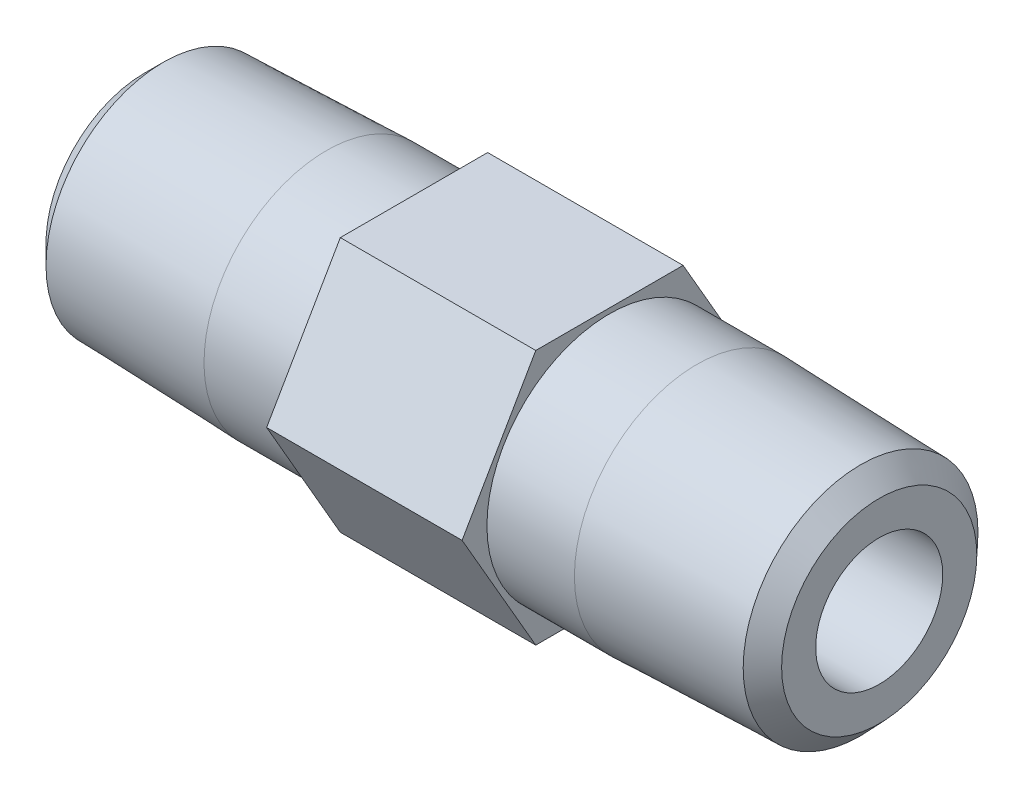
ISO-10303-21;
HEADER;
FILE_DESCRIPTION(('STEP AP214'),'2;1');
FILE_NAME('part.step','',(''),(''),'','','');
FILE_SCHEMA(('AUTOMOTIVE_DESIGN { 1 0 10303 214 1 1 1 1 }'));
ENDSEC;
DATA;
#1=APPLICATION_CONTEXT('core data for automotive mechanical design processes');
#2=APPLICATION_PROTOCOL_DEFINITION('international standard','automotive_design',2000,#1);
#3=PRODUCT_CONTEXT('',#1,'mechanical');
#4=PRODUCT('Part','Part','',(#3));
#5=PRODUCT_RELATED_PRODUCT_CATEGORY('part','',(#4));
#6=PRODUCT_DEFINITION_FORMATION('','',#4);
#7=PRODUCT_DEFINITION_CONTEXT('part definition',#1,'design');
#8=PRODUCT_DEFINITION('design','',#6,#7);
#9=PRODUCT_DEFINITION_SHAPE('','',#8);
#10=(LENGTH_UNIT() NAMED_UNIT(*) SI_UNIT(.MILLI.,.METRE.));
#11=(NAMED_UNIT(*) PLANE_ANGLE_UNIT() SI_UNIT($,.RADIAN.));
#12=(NAMED_UNIT(*) SI_UNIT($,.STERADIAN.) SOLID_ANGLE_UNIT());
#13=UNCERTAINTY_MEASURE_WITH_UNIT(LENGTH_MEASURE(1.E-05),#10,'distance_accuracy_value','');
#14=(GEOMETRIC_REPRESENTATION_CONTEXT(3) GLOBAL_UNCERTAINTY_ASSIGNED_CONTEXT((#13)) GLOBAL_UNIT_ASSIGNED_CONTEXT((#10,
#11,#12)) REPRESENTATION_CONTEXT('',''));
#15=CARTESIAN_POINT('',(0.,0.,0.));
#16=DIRECTION('',(0.,0.,1.));
#17=DIRECTION('',(1.,0.,0.));
#18=AXIS2_PLACEMENT_3D('',#15,#16,#17);
#19=CARTESIAN_POINT('',(26.04516,0.,-8.24889197104678));
#20=DIRECTION('',(0.,-0.5,-0.866025403784438));
#21=DIRECTION('',(0.,0.866025403784438,-0.5));
#22=AXIS2_PLACEMENT_3D('',#19,#20,#21);
#23=PLANE('',#22);
#24=DIRECTION('',(0.,-0.866025403784438,0.5));
#25=VECTOR('',#24,1.);
#26=CARTESIAN_POINT('',(15.10284,0.,-8.24889197104678));
#27=LINE('',#26,#25);
#28=CARTESIAN_POINT('',(15.10284,0.,-8.24889197104678));
#29=VERTEX_POINT('',#28);
#30=CARTESIAN_POINT('',(15.10284,-7.14375,-4.12444598552339));
#31=VERTEX_POINT('',#30);
#32=EDGE_CURVE('E123',#29,#31,#27,.T.);
#33=ORIENTED_EDGE('',*,*,#32,.F.);
#34=DIRECTION('',(-1.,0.,0.));
#35=VECTOR('',#34,1.);
#36=CARTESIAN_POINT('',(26.04516,0.,-8.24889197104678));
#37=LINE('',#36,#35);
#38=CARTESIAN_POINT('',(26.04516,0.,-8.24889197104678));
#39=VERTEX_POINT('',#38);
#40=EDGE_CURVE('E52',#39,#29,#37,.T.);
#41=ORIENTED_EDGE('',*,*,#40,.F.);
#42=DIRECTION('',(0.,-0.866025403784438,0.5));
#43=VECTOR('',#42,1.);
#44=CARTESIAN_POINT('',(26.04516,0.,-8.24889197104678));
#45=LINE('',#44,#43);
#46=CARTESIAN_POINT('',(26.04516,-7.14375,-4.12444598552339));
#47=VERTEX_POINT('',#46);
#48=EDGE_CURVE('E139',#39,#47,#45,.T.);
#49=ORIENTED_EDGE('',*,*,#48,.T.);
#50=DIRECTION('',(-1.,0.,0.));
#51=VECTOR('',#50,1.);
#52=CARTESIAN_POINT('',(26.04516,-7.14375,-4.12444598552339));
#53=LINE('',#52,#51);
#54=EDGE_CURVE('E87',#47,#31,#53,.T.);
#55=ORIENTED_EDGE('',*,*,#54,.T.);
#56=EDGE_LOOP('',(#33,#41,#49,#55));
#57=FACE_BOUND('',#56,.T.);
#58=ADVANCED_FACE('F35',(#57),#23,.T.);
#59=CARTESIAN_POINT('',(26.04516,7.14375,-4.12444598552339));
#60=DIRECTION('',(0.,0.5,-0.866025403784439));
#61=DIRECTION('',(0.,0.866025403784439,0.5));
#62=AXIS2_PLACEMENT_3D('',#59,#60,#61);
#63=PLANE('',#62);
#64=DIRECTION('',(0.,-0.866025403784439,-0.5));
#65=VECTOR('',#64,1.);
#66=CARTESIAN_POINT('',(15.10284,7.14375,-4.12444598552339));
#67=LINE('',#66,#65);
#68=CARTESIAN_POINT('',(15.10284,7.14375,-4.12444598552339));
#69=VERTEX_POINT('',#68);
#70=EDGE_CURVE('E136',#69,#29,#67,.T.);
#71=ORIENTED_EDGE('',*,*,#70,.F.);
#72=DIRECTION('',(-1.,0.,0.));
#73=VECTOR('',#72,1.);
#74=CARTESIAN_POINT('',(26.04516,7.14375,-4.12444598552339));
#75=LINE('',#74,#73);
#76=CARTESIAN_POINT('',(26.04516,7.14375,-4.12444598552339));
#77=VERTEX_POINT('',#76);
#78=EDGE_CURVE('E75',#77,#69,#75,.T.);
#79=ORIENTED_EDGE('',*,*,#78,.F.);
#80=DIRECTION('',(0.,-0.866025403784439,-0.5));
#81=VECTOR('',#80,1.);
#82=CARTESIAN_POINT('',(26.04516,7.14375,-4.12444598552339));
#83=LINE('',#82,#81);
#84=EDGE_CURVE('E113',#77,#39,#83,.T.);
#85=ORIENTED_EDGE('',*,*,#84,.T.);
#86=ORIENTED_EDGE('',*,*,#40,.T.);
#87=EDGE_LOOP('',(#71,#79,#85,#86));
#88=FACE_BOUND('',#87,.T.);
#89=ADVANCED_FACE('F168',(#88),#63,.T.);
#90=CARTESIAN_POINT('',(26.04516,7.14375,4.12444598552339));
#91=DIRECTION('',(0.,1.,0.));
#92=DIRECTION('',(0.,0.,1.));
#93=AXIS2_PLACEMENT_3D('',#90,#91,#92);
#94=PLANE('',#93);
#95=DIRECTION('',(0.,0.,-1.));
#96=VECTOR('',#95,1.);
#97=CARTESIAN_POINT('',(15.10284,7.14375,4.12444598552339));
#98=LINE('',#97,#96);
#99=CARTESIAN_POINT('',(15.10284,7.14375,4.12444598552339));
#100=VERTEX_POINT('',#99);
#101=EDGE_CURVE('E100',#100,#69,#98,.T.);
#102=ORIENTED_EDGE('',*,*,#101,.F.);
#103=DIRECTION('',(-1.,0.,0.));
#104=VECTOR('',#103,1.);
#105=CARTESIAN_POINT('',(26.04516,7.14375,4.12444598552339));
#106=LINE('',#105,#104);
#107=CARTESIAN_POINT('',(26.04516,7.14375,4.12444598552339));
#108=VERTEX_POINT('',#107);
#109=EDGE_CURVE('E95',#108,#100,#106,.T.);
#110=ORIENTED_EDGE('',*,*,#109,.F.);
#111=DIRECTION('',(0.,0.,-1.));
#112=VECTOR('',#111,1.);
#113=CARTESIAN_POINT('',(26.04516,7.14375,4.12444598552339));
#114=LINE('',#113,#112);
#115=EDGE_CURVE('E98',#108,#77,#114,.T.);
#116=ORIENTED_EDGE('',*,*,#115,.T.);
#117=ORIENTED_EDGE('',*,*,#78,.T.);
#118=EDGE_LOOP('',(#102,#110,#116,#117));
#119=FACE_BOUND('',#118,.T.);
#120=ADVANCED_FACE('F97',(#119),#94,.T.);
#121=CARTESIAN_POINT('',(26.04516,0.,8.24889197104678));
#122=DIRECTION('',(0.,0.5,0.866025403784438));
#123=DIRECTION('',(0.,-0.866025403784439,0.5));
#124=AXIS2_PLACEMENT_3D('',#121,#122,#123);
#125=PLANE('',#124);
#126=DIRECTION('',(0.,0.866025403784439,-0.5));
#127=VECTOR('',#126,1.);
#128=CARTESIAN_POINT('',(15.10284,0.,8.24889197104678));
#129=LINE('',#128,#127);
#130=CARTESIAN_POINT('',(15.10284,0.,8.24889197104678));
#131=VERTEX_POINT('',#130);
#132=EDGE_CURVE('E133',#131,#100,#129,.T.);
#133=ORIENTED_EDGE('',*,*,#132,.F.);
#134=DIRECTION('',(-1.,0.,0.));
#135=VECTOR('',#134,1.);
#136=CARTESIAN_POINT('',(26.04516,0.,8.24889197104678));
#137=LINE('',#136,#135);
#138=CARTESIAN_POINT('',(26.04516,0.,8.24889197104678));
#139=VERTEX_POINT('',#138);
#140=EDGE_CURVE('E105',#139,#131,#137,.T.);
#141=ORIENTED_EDGE('',*,*,#140,.F.);
#142=DIRECTION('',(0.,0.866025403784439,-0.5));
#143=VECTOR('',#142,1.);
#144=CARTESIAN_POINT('',(26.04516,0.,8.24889197104678));
#145=LINE('',#144,#143);
#146=EDGE_CURVE('E111',#139,#108,#145,.T.);
#147=ORIENTED_EDGE('',*,*,#146,.T.);
#148=ORIENTED_EDGE('',*,*,#109,.T.);
#149=EDGE_LOOP('',(#133,#141,#147,#148));
#150=FACE_BOUND('',#149,.T.);
#151=ADVANCED_FACE('F115',(#150),#125,.T.);
#152=CARTESIAN_POINT('',(26.04516,-7.14375,4.12444598552339));
#153=DIRECTION('',(0.,-0.5,0.866025403784439));
#154=DIRECTION('',(0.,-0.866025403784439,-0.5));
#155=AXIS2_PLACEMENT_3D('',#152,#153,#154);
#156=PLANE('',#155);
#157=DIRECTION('',(0.,0.866025403784439,0.5));
#158=VECTOR('',#157,1.);
#159=CARTESIAN_POINT('',(15.10284,-7.14375,4.12444598552339));
#160=LINE('',#159,#158);
#161=CARTESIAN_POINT('',(15.10284,-7.14375,4.12444598552339));
#162=VERTEX_POINT('',#161);
#163=EDGE_CURVE('E130',#162,#131,#160,.T.);
#164=ORIENTED_EDGE('',*,*,#163,.F.);
#165=DIRECTION('',(-1.,0.,0.));
#166=VECTOR('',#165,1.);
#167=CARTESIAN_POINT('',(26.04516,-7.14375,4.12444598552339));
#168=LINE('',#167,#166);
#169=CARTESIAN_POINT('',(26.04516,-7.14375,4.12444598552339));
#170=VERTEX_POINT('',#169);
#171=EDGE_CURVE('E144',#170,#162,#168,.T.);
#172=ORIENTED_EDGE('',*,*,#171,.F.);
#173=DIRECTION('',(0.,0.866025403784439,0.5));
#174=VECTOR('',#173,1.);
#175=CARTESIAN_POINT('',(26.04516,-7.14375,4.12444598552339));
#176=LINE('',#175,#174);
#177=EDGE_CURVE('E116',#170,#139,#176,.T.);
#178=ORIENTED_EDGE('',*,*,#177,.T.);
#179=ORIENTED_EDGE('',*,*,#140,.T.);
#180=EDGE_LOOP('',(#164,#172,#178,#179));
#181=FACE_BOUND('',#180,.T.);
#182=ADVANCED_FACE('F178',(#181),#156,.T.);
#183=CARTESIAN_POINT('',(26.04516,-7.14375,-4.12444598552339));
#184=DIRECTION('',(0.,-1.,0.));
#185=DIRECTION('',(1.,0.,0.));
#186=AXIS2_PLACEMENT_3D('',#183,#184,#185);
#187=PLANE('',#186);
#188=DIRECTION('',(0.,0.,1.));
#189=VECTOR('',#188,1.);
#190=CARTESIAN_POINT('',(15.10284,-7.14375,-4.12444598552339));
#191=LINE('',#190,#189);
#192=EDGE_CURVE('E126',#31,#162,#191,.T.);
#193=ORIENTED_EDGE('',*,*,#192,.F.);
#194=ORIENTED_EDGE('',*,*,#54,.F.);
#195=DIRECTION('',(0.,0.,1.));
#196=VECTOR('',#195,1.);
#197=CARTESIAN_POINT('',(26.04516,-7.14375,-4.12444598552339));
#198=LINE('',#197,#196);
#199=EDGE_CURVE('E118',#47,#170,#198,.T.);
#200=ORIENTED_EDGE('',*,*,#199,.T.);
#201=ORIENTED_EDGE('',*,*,#171,.T.);
#202=EDGE_LOOP('',(#193,#194,#200,#201));
#203=FACE_BOUND('',#202,.T.);
#204=ADVANCED_FACE('F175',(#203),#187,.T.);
#205=CARTESIAN_POINT('',(26.04516,0.,0.));
#206=DIRECTION('',(-1.,0.,0.));
#207=DIRECTION('',(0.,0.,1.));
#208=AXIS2_PLACEMENT_3D('',#205,#206,#207);
#209=PLANE('',#208);
#210=CARTESIAN_POINT('',(26.04516,0.,0.));
#211=DIRECTION('',(-1.,0.,0.));
#212=DIRECTION('',(0.,0.,1.));
#213=AXIS2_PLACEMENT_3D('',#210,#211,#212);
#214=CIRCLE('',#213,6.85800000000114);
#215=CARTESIAN_POINT('',(26.04516,0.,6.85800000000114));
#216=VERTEX_POINT('',#215);
#217=EDGE_CURVE('E127',#216,#216,#214,.T.);
#218=ORIENTED_EDGE('',*,*,#217,.T.);
#219=EDGE_LOOP('',(#218));
#220=FACE_BOUND('',#219,.T.);
#221=ORIENTED_EDGE('',*,*,#48,.F.);
#222=ORIENTED_EDGE('',*,*,#84,.F.);
#223=ORIENTED_EDGE('',*,*,#115,.F.);
#224=ORIENTED_EDGE('',*,*,#146,.F.);
#225=ORIENTED_EDGE('',*,*,#177,.F.);
#226=ORIENTED_EDGE('',*,*,#199,.F.);
#227=EDGE_LOOP('',(#221,#222,#223,#224,#225,#226));
#228=FACE_BOUND('',#227,.T.);
#229=ADVANCED_FACE('F109',(#220,#228),#209,.F.);
#230=CARTESIAN_POINT('',(15.10284,0.,0.));
#231=DIRECTION('',(-1.,0.,0.));
#232=DIRECTION('',(0.,0.,1.));
#233=AXIS2_PLACEMENT_3D('',#230,#231,#232);
#234=PLANE('',#233);
#235=CARTESIAN_POINT('',(15.10284,0.,0.));
#236=DIRECTION('',(-1.,0.,0.));
#237=DIRECTION('',(0.,-1.,0.));
#238=AXIS2_PLACEMENT_3D('',#235,#236,#237);
#239=CIRCLE('',#238,6.858);
#240=CARTESIAN_POINT('',(15.10284,-6.858,0.));
#241=VERTEX_POINT('',#240);
#242=EDGE_CURVE('E141',#241,#241,#239,.T.);
#243=ORIENTED_EDGE('',*,*,#242,.F.);
#244=EDGE_LOOP('',(#243));
#245=FACE_BOUND('',#244,.T.);
#246=ORIENTED_EDGE('',*,*,#32,.T.);
#247=ORIENTED_EDGE('',*,*,#192,.T.);
#248=ORIENTED_EDGE('',*,*,#163,.T.);
#249=ORIENTED_EDGE('',*,*,#132,.T.);
#250=ORIENTED_EDGE('',*,*,#101,.T.);
#251=ORIENTED_EDGE('',*,*,#70,.T.);
#252=EDGE_LOOP('',(#246,#247,#248,#249,#250,#251));
#253=FACE_BOUND('',#252,.T.);
#254=ADVANCED_FACE('F186',(#245,#253),#234,.T.);
#255=CARTESIAN_POINT('',(30.9422799999766,0.,0.));
#256=DIRECTION('',(-1.,0.,0.));
#257=DIRECTION('',(0.,0.,1.));
#258=AXIS2_PLACEMENT_3D('',#255,#256,#257);
#259=CONICAL_SURFACE('',#258,6.85800000000114,0.0311250383214261);
#260=CARTESIAN_POINT('',(40.106090931225,0.,0.));
#261=DIRECTION('',(1.,0.,0.));
#262=DIRECTION('',(0.,0.,-1.));
#263=AXIS2_PLACEMENT_3D('',#260,#261,#262);
#264=CIRCLE('',#263,6.57268389260544);
#265=CARTESIAN_POINT('',(40.106090931225,0.,-6.57268389260544));
#266=VERTEX_POINT('',#265);
#267=EDGE_CURVE('E147',#266,#266,#264,.F.);
#268=ORIENTED_EDGE('',*,*,#267,.T.);
#269=EDGE_LOOP('',(#268));
#270=FACE_BOUND('',#269,.T.);
#271=CARTESIAN_POINT('',(30.9422799999766,0.,0.));
#272=DIRECTION('',(-1.,0.,0.));
#273=DIRECTION('',(0.,0.,1.));
#274=AXIS2_PLACEMENT_3D('',#271,#272,#273);
#275=CIRCLE('',#274,6.85800000000114);
#276=CARTESIAN_POINT('',(30.9422799999766,0.,6.85800000000114));
#277=VERTEX_POINT('',#276);
#278=EDGE_CURVE('E250',#277,#277,#275,.T.);
#279=ORIENTED_EDGE('',*,*,#278,.F.);
#280=EDGE_LOOP('',(#279));
#281=FACE_BOUND('',#280,.T.);
#282=ADVANCED_FACE('F189',(#270,#281),#259,.T.);
#283=CARTESIAN_POINT('',(41.148,6.54024395664501,0.));
#284=DIRECTION('',(1.,0.,0.));
#285=DIRECTION('',(0.,0.,-1.));
#286=AXIS2_PLACEMENT_3D('',#283,#284,#285);
#287=PLANE('',#286);
#288=CARTESIAN_POINT('',(41.148,0.,0.));
#289=DIRECTION('',(1.,0.,0.));
#290=DIRECTION('',(0.,0.,-1.));
#291=AXIS2_PLACEMENT_3D('',#288,#289,#290);
#292=CIRCLE('',#291,5.46380999574616);
#293=CARTESIAN_POINT('',(41.148,0.,-5.46380999574616));
#294=VERTEX_POINT('',#293);
#295=EDGE_CURVE('E150',#294,#294,#292,.T.);
#296=ORIENTED_EDGE('',*,*,#295,.T.);
#297=EDGE_LOOP('',(#296));
#298=FACE_BOUND('',#297,.T.);
#299=CARTESIAN_POINT('',(41.148,0.,0.));
#300=DIRECTION('',(1.,0.,0.));
#301=DIRECTION('',(0.,0.,-1.));
#302=AXIS2_PLACEMENT_3D('',#299,#300,#301);
#303=CIRCLE('',#302,3.55599999999999);
#304=CARTESIAN_POINT('',(41.148,0.,-3.55599999999999));
#305=VERTEX_POINT('',#304);
#306=EDGE_CURVE('E239',#305,#305,#303,.T.);
#307=ORIENTED_EDGE('',*,*,#306,.F.);
#308=EDGE_LOOP('',(#307));
#309=FACE_BOUND('',#308,.T.);
#310=ADVANCED_FACE('F196',(#298,#309),#287,.T.);
#311=CARTESIAN_POINT('',(41.148,0.,0.));
#312=DIRECTION('',(-1.,0.,0.));
#313=DIRECTION('',(0.,0.,1.));
#314=AXIS2_PLACEMENT_3D('',#311,#312,#313);
#315=CYLINDRICAL_SURFACE('',#314,6.85800000000114);
#316=ORIENTED_EDGE('',*,*,#278,.T.);
#317=EDGE_LOOP('',(#316));
#318=FACE_BOUND('',#317,.T.);
#319=ORIENTED_EDGE('',*,*,#217,.F.);
#320=EDGE_LOOP('',(#319));
#321=FACE_BOUND('',#320,.T.);
#322=ADVANCED_FACE('F200',(#318,#321),#315,.T.);
#323=CARTESIAN_POINT('',(15.10284,0.,0.));
#324=DIRECTION('',(-1.,0.,0.));
#325=DIRECTION('',(0.,-1.,0.));
#326=AXIS2_PLACEMENT_3D('',#323,#324,#325);
#327=CYLINDRICAL_SURFACE('',#326,6.858);
#328=ORIENTED_EDGE('',*,*,#242,.T.);
#329=EDGE_LOOP('',(#328));
#330=FACE_BOUND('',#329,.T.);
#331=CARTESIAN_POINT('',(10.20572,0.,0.));
#332=DIRECTION('',(-1.,0.,0.));
#333=DIRECTION('',(0.,-1.,0.));
#334=AXIS2_PLACEMENT_3D('',#331,#332,#333);
#335=CIRCLE('',#334,6.858);
#336=CARTESIAN_POINT('',(10.20572,-6.858,0.));
#337=VERTEX_POINT('',#336);
#338=EDGE_CURVE('E247',#337,#337,#335,.T.);
#339=ORIENTED_EDGE('',*,*,#338,.F.);
#340=EDGE_LOOP('',(#339));
#341=FACE_BOUND('',#340,.T.);
#342=ADVANCED_FACE('F204',(#330,#341),#327,.T.);
#343=CARTESIAN_POINT('',(0.,0.,0.));
#344=DIRECTION('',(-1.,0.,0.));
#345=DIRECTION('',(0.,-1.,0.));
#346=AXIS2_PLACEMENT_3D('',#343,#344,#345);
#347=PLANE('',#346);
#348=CARTESIAN_POINT('',(0.,0.,0.));
#349=DIRECTION('',(-1.,0.,0.));
#350=DIRECTION('',(0.,-1.,0.));
#351=AXIS2_PLACEMENT_3D('',#348,#349,#350);
#352=CIRCLE('',#351,5.49782999998399);
#353=CARTESIAN_POINT('',(0.,-5.49782999998399,0.));
#354=VERTEX_POINT('',#353);
#355=EDGE_CURVE('E44',#354,#354,#352,.T.);
#356=ORIENTED_EDGE('',*,*,#355,.T.);
#357=EDGE_LOOP('',(#356));
#358=FACE_BOUND('',#357,.T.);
#359=CARTESIAN_POINT('',(0.,0.,0.));
#360=DIRECTION('',(-1.,0.,0.));
#361=DIRECTION('',(0.,0.,1.));
#362=AXIS2_PLACEMENT_3D('',#359,#360,#361);
#363=CIRCLE('',#362,3.55599999999999);
#364=CARTESIAN_POINT('',(0.,0.,3.55599999999999));
#365=VERTEX_POINT('',#364);
#366=EDGE_CURVE('E237',#365,#365,#363,.T.);
#367=ORIENTED_EDGE('',*,*,#366,.F.);
#368=EDGE_LOOP('',(#367));
#369=FACE_BOUND('',#368,.T.);
#370=ADVANCED_FACE('F155',(#358,#369),#347,.T.);
#371=CARTESIAN_POINT('',(0.,0.,0.));
#372=DIRECTION('',(1.,0.,0.));
#373=DIRECTION('',(0.,1.,0.));
#374=AXIS2_PLACEMENT_3D('',#371,#372,#373);
#375=CONICAL_SURFACE('',#374,6.54024395664457,0.0311250383214294);
#376=CARTESIAN_POINT('',(1.07591259559769,0.,0.));
#377=DIRECTION('',(-1.,0.,0.));
#378=DIRECTION('',(0.,-1.,0.));
#379=AXIS2_PLACEMENT_3D('',#376,#377,#378);
#380=CIRCLE('',#379,6.57374259558169);
#381=CARTESIAN_POINT('',(1.07591259559769,-6.57374259558169,0.));
#382=VERTEX_POINT('',#381);
#383=EDGE_CURVE('E11',#382,#382,#380,.F.);
#384=ORIENTED_EDGE('',*,*,#383,.T.);
#385=EDGE_LOOP('',(#384));
#386=FACE_BOUND('',#385,.T.);
#387=ORIENTED_EDGE('',*,*,#338,.T.);
#388=EDGE_LOOP('',(#387));
#389=FACE_BOUND('',#388,.T.);
#390=ADVANCED_FACE('F211',(#386,#389),#375,.T.);
#391=CARTESIAN_POINT('',(26.04516,0.,0.));
#392=DIRECTION('',(-1.,0.,0.));
#393=DIRECTION('',(0.,0.,1.));
#394=AXIS2_PLACEMENT_3D('',#391,#392,#393);
#395=PLANE('',#394);
#396=CARTESIAN_POINT('',(26.04516,0.,0.));
#397=DIRECTION('',(1.,0.,0.));
#398=DIRECTION('',(0.,0.,-1.));
#399=AXIS2_PLACEMENT_3D('',#396,#397,#398);
#400=CIRCLE('',#399,3.55599999999999);
#401=CARTESIAN_POINT('',(26.04516,0.,-3.55599999999999));
#402=VERTEX_POINT('',#401);
#403=EDGE_CURVE('E244',#402,#402,#400,.T.);
#404=ORIENTED_EDGE('',*,*,#403,.T.);
#405=EDGE_LOOP('',(#404));
#406=FACE_BOUND('',#405,.T.);
#407=ADVANCED_FACE('F214',(#406),#395,.F.);
#408=CARTESIAN_POINT('',(41.148,0.,0.));
#409=DIRECTION('',(1.,0.,0.));
#410=DIRECTION('',(0.,0.,-1.));
#411=AXIS2_PLACEMENT_3D('',#408,#409,#410);
#412=CYLINDRICAL_SURFACE('',#411,3.55599999999999);
#413=ORIENTED_EDGE('',*,*,#403,.F.);
#414=EDGE_LOOP('',(#413));
#415=FACE_BOUND('',#414,.T.);
#416=ORIENTED_EDGE('',*,*,#306,.T.);
#417=EDGE_LOOP('',(#416));
#418=FACE_BOUND('',#417,.T.);
#419=ADVANCED_FACE('F218',(#415,#418),#412,.F.);
#420=CARTESIAN_POINT('',(15.10284,0.,0.));
#421=DIRECTION('',(1.,0.,0.));
#422=DIRECTION('',(0.,0.,-1.));
#423=AXIS2_PLACEMENT_3D('',#420,#421,#422);
#424=PLANE('',#423);
#425=CARTESIAN_POINT('',(15.10284,0.,0.));
#426=DIRECTION('',(-1.,0.,0.));
#427=DIRECTION('',(0.,0.,1.));
#428=AXIS2_PLACEMENT_3D('',#425,#426,#427);
#429=CIRCLE('',#428,3.55599999999999);
#430=CARTESIAN_POINT('',(15.10284,0.,3.55599999999999));
#431=VERTEX_POINT('',#430);
#432=EDGE_CURVE('E234',#431,#431,#429,.T.);
#433=ORIENTED_EDGE('',*,*,#432,.T.);
#434=EDGE_LOOP('',(#433));
#435=FACE_BOUND('',#434,.T.);
#436=ADVANCED_FACE('F222',(#435),#424,.F.);
#437=CARTESIAN_POINT('',(0.,0.,0.));
#438=DIRECTION('',(-1.,0.,0.));
#439=DIRECTION('',(0.,0.,1.));
#440=AXIS2_PLACEMENT_3D('',#437,#438,#439);
#441=CYLINDRICAL_SURFACE('',#440,3.55599999999999);
#442=ORIENTED_EDGE('',*,*,#432,.F.);
#443=EDGE_LOOP('',(#442));
#444=FACE_BOUND('',#443,.T.);
#445=ORIENTED_EDGE('',*,*,#366,.T.);
#446=EDGE_LOOP('',(#445));
#447=FACE_BOUND('',#446,.T.);
#448=ADVANCED_FACE('F164',(#444,#447),#441,.F.);
#449=CARTESIAN_POINT('',(40.106090931225,0.,0.));
#450=DIRECTION('',(-1.,0.,0.));
#451=DIRECTION('',(0.,0.,1.));
#452=AXIS2_PLACEMENT_3D('',#449,#450,#451);
#453=CONICAL_SURFACE('',#452,6.57268389260544,0.816523201718873);
#454=ORIENTED_EDGE('',*,*,#295,.F.);
#455=EDGE_LOOP('',(#454));
#456=FACE_BOUND('',#455,.T.);
#457=ORIENTED_EDGE('',*,*,#267,.F.);
#458=EDGE_LOOP('',(#457));
#459=FACE_BOUND('',#458,.T.);
#460=ADVANCED_FACE('F159',(#456,#459),#453,.T.);
#461=CARTESIAN_POINT('',(0.,0.,0.));
#462=DIRECTION('',(1.,0.,0.));
#463=DIRECTION('',(0.,1.,0.));
#464=AXIS2_PLACEMENT_3D('',#461,#462,#463);
#465=CONICAL_SURFACE('',#464,5.49782999998399,0.785398163397452);
#466=ORIENTED_EDGE('',*,*,#383,.F.);
#467=EDGE_LOOP('',(#466));
#468=FACE_BOUND('',#467,.T.);
#469=ORIENTED_EDGE('',*,*,#355,.F.);
#470=EDGE_LOOP('',(#469));
#471=FACE_BOUND('',#470,.T.);
#472=ADVANCED_FACE('F37',(#468,#471),#465,.T.);
#473=CLOSED_SHELL('',(#58,#89,#120,#151,#182,#204,#229,#254,#282,#310,#322,#342,#370,#390,#407,
#419,#436,#448,#460,#472));
#474=MANIFOLD_SOLID_BREP('B2',#473);
#475=ADVANCED_BREP_SHAPE_REPRESENTATION('',(#18,#474),#14);
#476=SHAPE_DEFINITION_REPRESENTATION(#9,#475);
ENDSEC;
END-ISO-10303-21;
